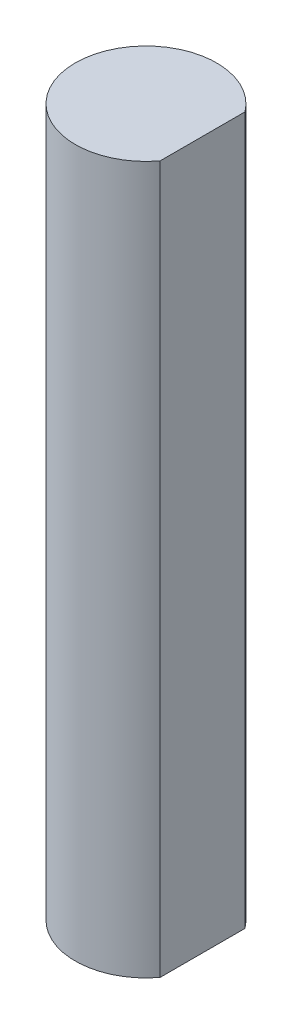
ISO-10303-21;
HEADER;
FILE_DESCRIPTION(('STEP AP214'),'2;1');
FILE_NAME('part.step','',(''),(''),'','','');
FILE_SCHEMA(('AUTOMOTIVE_DESIGN { 1 0 10303 214 1 1 1 1 }'));
ENDSEC;
DATA;
#1=APPLICATION_CONTEXT('core data for automotive mechanical design processes');
#2=APPLICATION_PROTOCOL_DEFINITION('international standard','automotive_design',2000,#1);
#3=PRODUCT_CONTEXT('',#1,'mechanical');
#4=PRODUCT('Part','Part','',(#3));
#5=PRODUCT_RELATED_PRODUCT_CATEGORY('part','',(#4));
#6=PRODUCT_DEFINITION_FORMATION('','',#4);
#7=PRODUCT_DEFINITION_CONTEXT('part definition',#1,'design');
#8=PRODUCT_DEFINITION('design','',#6,#7);
#9=PRODUCT_DEFINITION_SHAPE('','',#8);
#10=(LENGTH_UNIT() NAMED_UNIT(*) SI_UNIT(.MILLI.,.METRE.));
#11=(NAMED_UNIT(*) PLANE_ANGLE_UNIT() SI_UNIT($,.RADIAN.));
#12=(NAMED_UNIT(*) SI_UNIT($,.STERADIAN.) SOLID_ANGLE_UNIT());
#13=UNCERTAINTY_MEASURE_WITH_UNIT(LENGTH_MEASURE(1.E-05),#10,'distance_accuracy_value','');
#14=(GEOMETRIC_REPRESENTATION_CONTEXT(3) GLOBAL_UNCERTAINTY_ASSIGNED_CONTEXT((#13)) GLOBAL_UNIT_ASSIGNED_CONTEXT((#10,
#11,#12)) REPRESENTATION_CONTEXT('',''));
#15=CARTESIAN_POINT('',(0.,0.,0.));
#16=DIRECTION('',(0.,0.,1.));
#17=DIRECTION('',(1.,0.,0.));
#18=AXIS2_PLACEMENT_3D('',#15,#16,#17);
#19=CARTESIAN_POINT('',(0.,31.75,0.));
#20=DIRECTION('',(0.,-1.,0.));
#21=DIRECTION('',(0.,0.,-1.));
#22=AXIS2_PLACEMENT_3D('',#19,#20,#21);
#23=CYLINDRICAL_SURFACE('',#22,3.175);
#24=CARTESIAN_POINT('',(0.,0.,0.));
#25=DIRECTION('',(0.,1.,0.));
#26=DIRECTION('',(0.,0.,1.));
#27=AXIS2_PLACEMENT_3D('',#24,#25,#26);
#28=CIRCLE('',#27,3.175);
#29=CARTESIAN_POINT('',(2.54,0.,-1.905));
#30=VERTEX_POINT('',#29);
#31=CARTESIAN_POINT('',(2.54,0.,1.905));
#32=VERTEX_POINT('',#31);
#33=EDGE_CURVE('E66',#30,#32,#28,.T.);
#34=ORIENTED_EDGE('',*,*,#33,.T.);
#35=DIRECTION('',(0.,-1.,0.));
#36=VECTOR('',#35,1.);
#37=CARTESIAN_POINT('',(2.54,31.75,1.905));
#38=LINE('',#37,#36);
#39=CARTESIAN_POINT('',(2.54,31.75,1.905));
#40=VERTEX_POINT('',#39);
#41=EDGE_CURVE('E11',#40,#32,#38,.T.);
#42=ORIENTED_EDGE('',*,*,#41,.F.);
#43=CARTESIAN_POINT('',(0.,31.75,0.));
#44=DIRECTION('',(0.,1.,0.));
#45=DIRECTION('',(0.,0.,1.));
#46=AXIS2_PLACEMENT_3D('',#43,#44,#45);
#47=CIRCLE('',#46,3.175);
#48=CARTESIAN_POINT('',(2.54,31.75,-1.905));
#49=VERTEX_POINT('',#48);
#50=EDGE_CURVE('E68',#49,#40,#47,.T.);
#51=ORIENTED_EDGE('',*,*,#50,.F.);
#52=DIRECTION('',(0.,-1.,0.));
#53=VECTOR('',#52,1.);
#54=CARTESIAN_POINT('',(2.54,31.75,-1.905));
#55=LINE('',#54,#53);
#56=EDGE_CURVE('E50',#49,#30,#55,.T.);
#57=ORIENTED_EDGE('',*,*,#56,.T.);
#58=EDGE_LOOP('',(#34,#42,#51,#57));
#59=FACE_BOUND('',#58,.T.);
#60=ADVANCED_FACE('F41',(#59),#23,.T.);
#61=CARTESIAN_POINT('',(2.54,31.75,0.));
#62=DIRECTION('',(1.,0.,0.));
#63=DIRECTION('',(0.,0.,-1.));
#64=AXIS2_PLACEMENT_3D('',#61,#62,#63);
#65=PLANE('',#64);
#66=DIRECTION('',(0.,0.,1.));
#67=VECTOR('',#66,1.);
#68=CARTESIAN_POINT('',(2.54,0.,0.));
#69=LINE('',#68,#67);
#70=EDGE_CURVE('E74',#30,#32,#69,.T.);
#71=ORIENTED_EDGE('',*,*,#70,.F.);
#72=ORIENTED_EDGE('',*,*,#56,.F.);
#73=DIRECTION('',(0.,0.,1.));
#74=VECTOR('',#73,1.);
#75=CARTESIAN_POINT('',(2.54,31.75,0.));
#76=LINE('',#75,#74);
#77=EDGE_CURVE('E71',#49,#40,#76,.T.);
#78=ORIENTED_EDGE('',*,*,#77,.T.);
#79=ORIENTED_EDGE('',*,*,#41,.T.);
#80=EDGE_LOOP('',(#71,#72,#78,#79));
#81=FACE_BOUND('',#80,.T.);
#82=ADVANCED_FACE('F77',(#81),#65,.T.);
#83=CARTESIAN_POINT('',(0.,31.75,0.));
#84=DIRECTION('',(0.,1.,0.));
#85=DIRECTION('',(0.,0.,1.));
#86=AXIS2_PLACEMENT_3D('',#83,#84,#85);
#87=PLANE('',#86);
#88=ORIENTED_EDGE('',*,*,#50,.T.);
#89=ORIENTED_EDGE('',*,*,#77,.F.);
#90=EDGE_LOOP('',(#88,#89));
#91=FACE_BOUND('',#90,.T.);
#92=ADVANCED_FACE('F85',(#91),#87,.T.);
#93=CARTESIAN_POINT('',(0.,0.,0.));
#94=DIRECTION('',(0.,1.,0.));
#95=DIRECTION('',(0.,0.,1.));
#96=AXIS2_PLACEMENT_3D('',#93,#94,#95);
#97=PLANE('',#96);
#98=ORIENTED_EDGE('',*,*,#33,.F.);
#99=ORIENTED_EDGE('',*,*,#70,.T.);
#100=EDGE_LOOP('',(#98,#99));
#101=FACE_BOUND('',#100,.T.);
#102=ADVANCED_FACE('F73',(#101),#97,.F.);
#103=CLOSED_SHELL('',(#60,#82,#92,#102));
#104=MANIFOLD_SOLID_BREP('B2',#103);
#105=ADVANCED_BREP_SHAPE_REPRESENTATION('',(#18,#104),#14);
#106=SHAPE_DEFINITION_REPRESENTATION(#9,#105);
ENDSEC;
END-ISO-10303-21;
